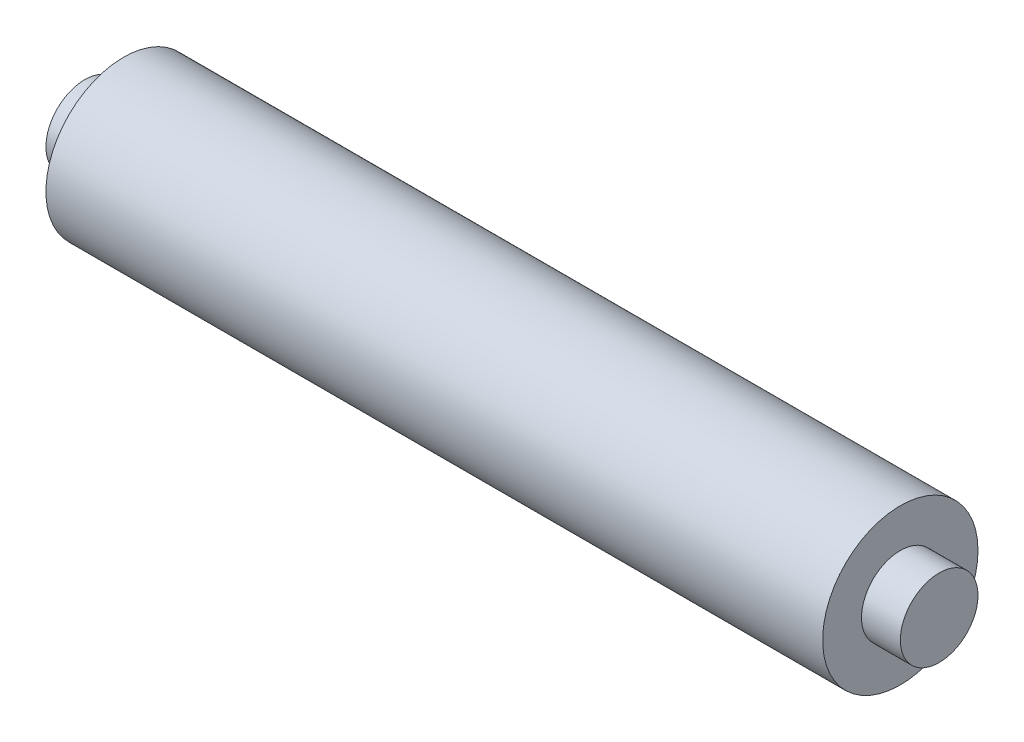
ISO-10303-21;
HEADER;
FILE_DESCRIPTION(('STEP AP214'),'2;1');
FILE_NAME('part.step','',(''),(''),'','','');
FILE_SCHEMA(('AUTOMOTIVE_DESIGN { 1 0 10303 214 1 1 1 1 }'));
ENDSEC;
DATA;
#1=APPLICATION_CONTEXT('core data for automotive mechanical design processes');
#2=APPLICATION_PROTOCOL_DEFINITION('international standard','automotive_design',2000,#1);
#3=PRODUCT_CONTEXT('',#1,'mechanical');
#4=PRODUCT('Part','Part','',(#3));
#5=PRODUCT_RELATED_PRODUCT_CATEGORY('part','',(#4));
#6=PRODUCT_DEFINITION_FORMATION('','',#4);
#7=PRODUCT_DEFINITION_CONTEXT('part definition',#1,'design');
#8=PRODUCT_DEFINITION('design','',#6,#7);
#9=PRODUCT_DEFINITION_SHAPE('','',#8);
#10=(LENGTH_UNIT() NAMED_UNIT(*) SI_UNIT(.MILLI.,.METRE.));
#11=(NAMED_UNIT(*) PLANE_ANGLE_UNIT() SI_UNIT($,.RADIAN.));
#12=(NAMED_UNIT(*) SI_UNIT($,.STERADIAN.) SOLID_ANGLE_UNIT());
#13=UNCERTAINTY_MEASURE_WITH_UNIT(LENGTH_MEASURE(1.E-05),#10,'distance_accuracy_value','');
#14=(GEOMETRIC_REPRESENTATION_CONTEXT(3) GLOBAL_UNCERTAINTY_ASSIGNED_CONTEXT((#13)) GLOBAL_UNIT_ASSIGNED_CONTEXT((#10,
#11,#12)) REPRESENTATION_CONTEXT('',''));
#15=CARTESIAN_POINT('',(0.,0.,0.));
#16=DIRECTION('',(0.,0.,1.));
#17=DIRECTION('',(1.,0.,0.));
#18=AXIS2_PLACEMENT_3D('',#15,#16,#17);
#19=CARTESIAN_POINT('',(76.2,0.,0.));
#20=DIRECTION('',(-1.,0.,0.));
#21=DIRECTION('',(0.,0.,1.));
#22=AXIS2_PLACEMENT_3D('',#19,#20,#21);
#23=CYLINDRICAL_SURFACE('',#22,76.2);
#24=CARTESIAN_POINT('',(76.2,0.,0.));
#25=DIRECTION('',(1.,0.,0.));
#26=DIRECTION('',(0.,0.,-1.));
#27=AXIS2_PLACEMENT_3D('',#24,#25,#26);
#28=CIRCLE('',#27,76.2);
#29=CARTESIAN_POINT('',(76.2,0.,-76.2));
#30=VERTEX_POINT('',#29);
#31=EDGE_CURVE('E38',#30,#30,#28,.T.);
#32=ORIENTED_EDGE('',*,*,#31,.F.);
#33=EDGE_LOOP('',(#32));
#34=FACE_BOUND('',#33,.T.);
#35=CARTESIAN_POINT('',(0.,0.,0.));
#36=DIRECTION('',(1.,0.,0.));
#37=DIRECTION('',(0.,0.,-1.));
#38=AXIS2_PLACEMENT_3D('',#35,#36,#37);
#39=CIRCLE('',#38,76.2);
#40=CARTESIAN_POINT('',(0.,0.,-76.2));
#41=VERTEX_POINT('',#40);
#42=EDGE_CURVE('E34',#41,#41,#39,.T.);
#43=ORIENTED_EDGE('',*,*,#42,.T.);
#44=EDGE_LOOP('',(#43));
#45=FACE_BOUND('',#44,.T.);
#46=ADVANCED_FACE('F31',(#34,#45),#23,.T.);
#47=CARTESIAN_POINT('',(0.,0.,0.));
#48=DIRECTION('',(1.,0.,0.));
#49=DIRECTION('',(0.,0.,-1.));
#50=AXIS2_PLACEMENT_3D('',#47,#48,#49);
#51=PLANE('',#50);
#52=ORIENTED_EDGE('',*,*,#42,.F.);
#53=EDGE_LOOP('',(#52));
#54=FACE_BOUND('',#53,.T.);
#55=ADVANCED_FACE('F72',(#54),#51,.F.);
#56=CARTESIAN_POINT('',(1600.2,0.,0.));
#57=DIRECTION('',(-1.,0.,0.));
#58=DIRECTION('',(0.,0.,1.));
#59=AXIS2_PLACEMENT_3D('',#56,#57,#58);
#60=CYLINDRICAL_SURFACE('',#59,152.4);
#61=CARTESIAN_POINT('',(1600.2,0.,0.));
#62=DIRECTION('',(1.,0.,0.));
#63=DIRECTION('',(0.,0.,-1.));
#64=AXIS2_PLACEMENT_3D('',#61,#62,#63);
#65=CIRCLE('',#64,152.4);
#66=CARTESIAN_POINT('',(1600.2,0.,-152.4));
#67=VERTEX_POINT('',#66);
#68=EDGE_CURVE('E46',#67,#67,#65,.T.);
#69=ORIENTED_EDGE('',*,*,#68,.F.);
#70=EDGE_LOOP('',(#69));
#71=FACE_BOUND('',#70,.T.);
#72=CARTESIAN_POINT('',(76.2,0.,0.));
#73=DIRECTION('',(1.,0.,0.));
#74=DIRECTION('',(0.,0.,-1.));
#75=AXIS2_PLACEMENT_3D('',#72,#73,#74);
#76=CIRCLE('',#75,152.4);
#77=CARTESIAN_POINT('',(76.2,0.,-152.4));
#78=VERTEX_POINT('',#77);
#79=EDGE_CURVE('E49',#78,#78,#76,.T.);
#80=ORIENTED_EDGE('',*,*,#79,.T.);
#81=EDGE_LOOP('',(#80));
#82=FACE_BOUND('',#81,.T.);
#83=ADVANCED_FACE('F77',(#71,#82),#60,.T.);
#84=CARTESIAN_POINT('',(1600.2,0.,0.));
#85=DIRECTION('',(1.,0.,0.));
#86=DIRECTION('',(0.,0.,-1.));
#87=AXIS2_PLACEMENT_3D('',#84,#85,#86);
#88=PLANE('',#87);
#89=CARTESIAN_POINT('',(1600.2,0.,0.));
#90=DIRECTION('',(1.,0.,0.));
#91=DIRECTION('',(0.,0.,-1.));
#92=AXIS2_PLACEMENT_3D('',#89,#90,#91);
#93=CIRCLE('',#92,76.2);
#94=CARTESIAN_POINT('',(1600.2,0.,-76.2));
#95=VERTEX_POINT('',#94);
#96=EDGE_CURVE('E10',#95,#95,#93,.T.);
#97=ORIENTED_EDGE('',*,*,#96,.F.);
#98=EDGE_LOOP('',(#97));
#99=FACE_BOUND('',#98,.T.);
#100=ORIENTED_EDGE('',*,*,#68,.T.);
#101=EDGE_LOOP('',(#100));
#102=FACE_BOUND('',#101,.T.);
#103=ADVANCED_FACE('F67',(#99,#102),#88,.T.);
#104=CARTESIAN_POINT('',(76.2,0.,0.));
#105=DIRECTION('',(1.,0.,0.));
#106=DIRECTION('',(0.,0.,-1.));
#107=AXIS2_PLACEMENT_3D('',#104,#105,#106);
#108=PLANE('',#107);
#109=ORIENTED_EDGE('',*,*,#31,.T.);
#110=EDGE_LOOP('',(#109));
#111=FACE_BOUND('',#110,.T.);
#112=ORIENTED_EDGE('',*,*,#79,.F.);
#113=EDGE_LOOP('',(#112));
#114=FACE_BOUND('',#113,.T.);
#115=ADVANCED_FACE('F60',(#111,#114),#108,.F.);
#116=CARTESIAN_POINT('',(1676.4,0.,0.));
#117=DIRECTION('',(-1.,0.,0.));
#118=DIRECTION('',(0.,0.,1.));
#119=AXIS2_PLACEMENT_3D('',#116,#117,#118);
#120=CYLINDRICAL_SURFACE('',#119,76.2);
#121=CARTESIAN_POINT('',(1676.4,0.,0.));
#122=DIRECTION('',(1.,0.,0.));
#123=DIRECTION('',(0.,0.,-1.));
#124=AXIS2_PLACEMENT_3D('',#121,#122,#123);
#125=CIRCLE('',#124,76.2);
#126=CARTESIAN_POINT('',(1676.4,0.,-76.2));
#127=VERTEX_POINT('',#126);
#128=EDGE_CURVE('E45',#127,#127,#125,.T.);
#129=ORIENTED_EDGE('',*,*,#128,.F.);
#130=EDGE_LOOP('',(#129));
#131=FACE_BOUND('',#130,.T.);
#132=ORIENTED_EDGE('',*,*,#96,.T.);
#133=EDGE_LOOP('',(#132));
#134=FACE_BOUND('',#133,.T.);
#135=ADVANCED_FACE('F58',(#131,#134),#120,.T.);
#136=CARTESIAN_POINT('',(1676.4,0.,0.));
#137=DIRECTION('',(1.,0.,0.));
#138=DIRECTION('',(0.,0.,-1.));
#139=AXIS2_PLACEMENT_3D('',#136,#137,#138);
#140=PLANE('',#139);
#141=ORIENTED_EDGE('',*,*,#128,.T.);
#142=EDGE_LOOP('',(#141));
#143=FACE_BOUND('',#142,.T.);
#144=ADVANCED_FACE('F56',(#143),#140,.T.);
#145=CLOSED_SHELL('',(#46,#55,#83,#103,#115,#135,#144));
#146=MANIFOLD_SOLID_BREP('B2',#145);
#147=ADVANCED_BREP_SHAPE_REPRESENTATION('',(#18,#146),#14);
#148=SHAPE_DEFINITION_REPRESENTATION(#9,#147);
ENDSEC;
END-ISO-10303-21;
